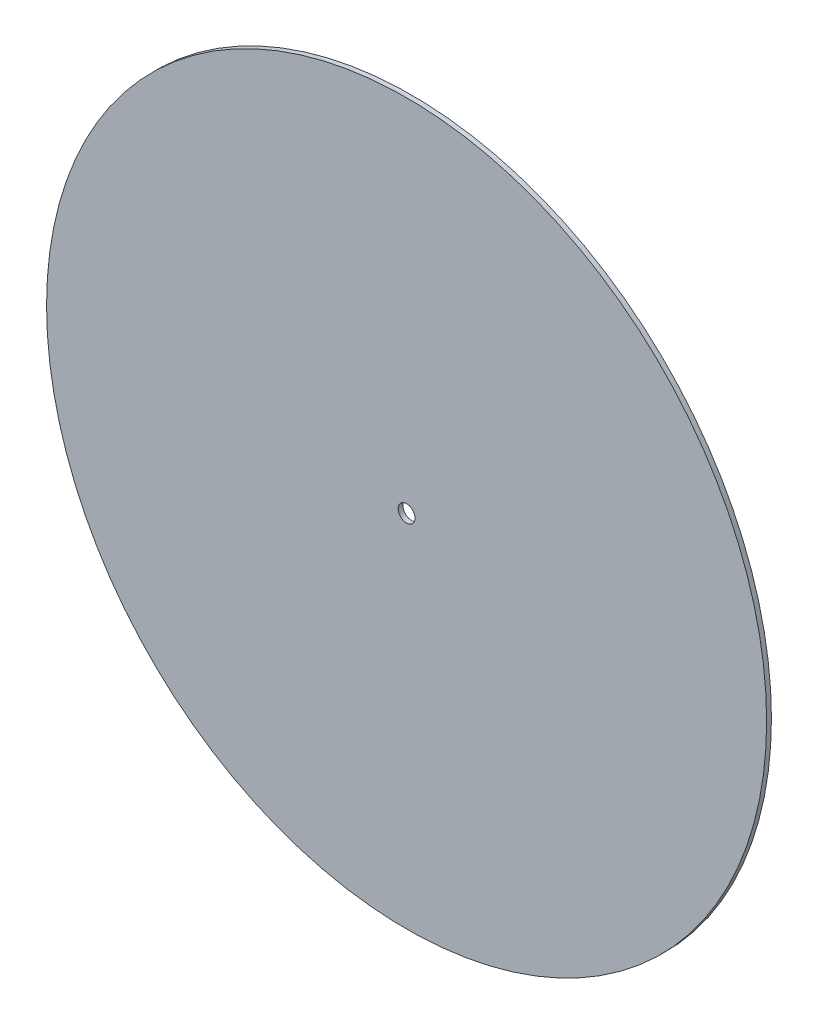
ISO-10303-21;
HEADER;
FILE_DESCRIPTION(('STEP AP214'),'2;1');
FILE_NAME('part.step','',(''),(''),'','','');
FILE_SCHEMA(('AUTOMOTIVE_DESIGN { 1 0 10303 214 1 1 1 1 }'));
ENDSEC;
DATA;
#1=APPLICATION_CONTEXT('core data for automotive mechanical design processes');
#2=APPLICATION_PROTOCOL_DEFINITION('international standard','automotive_design',2000,#1);
#3=PRODUCT_CONTEXT('',#1,'mechanical');
#4=PRODUCT('Part','Part','',(#3));
#5=PRODUCT_RELATED_PRODUCT_CATEGORY('part','',(#4));
#6=PRODUCT_DEFINITION_FORMATION('','',#4);
#7=PRODUCT_DEFINITION_CONTEXT('part definition',#1,'design');
#8=PRODUCT_DEFINITION('design','',#6,#7);
#9=PRODUCT_DEFINITION_SHAPE('','',#8);
#10=(LENGTH_UNIT() NAMED_UNIT(*) SI_UNIT(.MILLI.,.METRE.));
#11=(NAMED_UNIT(*) PLANE_ANGLE_UNIT() SI_UNIT($,.RADIAN.));
#12=(NAMED_UNIT(*) SI_UNIT($,.STERADIAN.) SOLID_ANGLE_UNIT());
#13=UNCERTAINTY_MEASURE_WITH_UNIT(LENGTH_MEASURE(1.E-05),#10,'distance_accuracy_value','');
#14=(GEOMETRIC_REPRESENTATION_CONTEXT(3) GLOBAL_UNCERTAINTY_ASSIGNED_CONTEXT((#13)) GLOBAL_UNIT_ASSIGNED_CONTEXT((#10,
#11,#12)) REPRESENTATION_CONTEXT('',''));
#15=CARTESIAN_POINT('',(0.,0.,0.));
#16=DIRECTION('',(0.,0.,1.));
#17=DIRECTION('',(1.,0.,0.));
#18=AXIS2_PLACEMENT_3D('',#15,#16,#17);
#19=CARTESIAN_POINT('',(0.,0.,0.));
#20=DIRECTION('',(0.,0.,1.));
#21=DIRECTION('',(1.,0.,0.));
#22=AXIS2_PLACEMENT_3D('',#19,#20,#21);
#23=PLANE('',#22);
#24=CARTESIAN_POINT('',(176.,173.,0.));
#25=DIRECTION('',(0.,0.,1.));
#26=DIRECTION('',(1.,0.,0.));
#27=AXIS2_PLACEMENT_3D('',#24,#25,#26);
#28=CIRCLE('',#27,3.5);
#29=CARTESIAN_POINT('',(179.5,173.,0.));
#30=VERTEX_POINT('',#29);
#31=EDGE_CURVE('E27',#30,#30,#28,.T.);
#32=ORIENTED_EDGE('',*,*,#31,.T.);
#33=EDGE_LOOP('',(#32));
#34=FACE_BOUND('',#33,.T.);
#35=CARTESIAN_POINT('',(176.,173.,0.));
#36=DIRECTION('',(0.,0.,1.));
#37=DIRECTION('',(1.,0.,0.));
#38=AXIS2_PLACEMENT_3D('',#35,#36,#37);
#39=CIRCLE('',#38,150.);
#40=CARTESIAN_POINT('',(326.,173.,0.));
#41=VERTEX_POINT('',#40);
#42=EDGE_CURVE('E18',#41,#41,#39,.T.);
#43=ORIENTED_EDGE('',*,*,#42,.F.);
#44=EDGE_LOOP('',(#43));
#45=FACE_BOUND('',#44,.T.);
#46=ADVANCED_FACE('F15',(#34,#45),#23,.F.);
#47=CARTESIAN_POINT('',(176.,173.,0.));
#48=DIRECTION('',(0.,0.,1.));
#49=DIRECTION('',(1.,0.,0.));
#50=AXIS2_PLACEMENT_3D('',#47,#48,#49);
#51=CYLINDRICAL_SURFACE('',#50,150.);
#52=ORIENTED_EDGE('',*,*,#42,.T.);
#53=EDGE_LOOP('',(#52));
#54=FACE_BOUND('',#53,.T.);
#55=CARTESIAN_POINT('',(176.,173.,2.));
#56=DIRECTION('',(0.,0.,1.));
#57=DIRECTION('',(1.,0.,0.));
#58=AXIS2_PLACEMENT_3D('',#55,#56,#57);
#59=CIRCLE('',#58,150.);
#60=CARTESIAN_POINT('',(326.,173.,2.));
#61=VERTEX_POINT('',#60);
#62=EDGE_CURVE('E22',#61,#61,#59,.T.);
#63=ORIENTED_EDGE('',*,*,#62,.F.);
#64=EDGE_LOOP('',(#63));
#65=FACE_BOUND('',#64,.T.);
#66=ADVANCED_FACE('F35',(#54,#65),#51,.T.);
#67=CARTESIAN_POINT('',(176.,173.,0.));
#68=DIRECTION('',(0.,0.,1.));
#69=DIRECTION('',(1.,0.,0.));
#70=AXIS2_PLACEMENT_3D('',#67,#68,#69);
#71=CYLINDRICAL_SURFACE('',#70,3.5);
#72=ORIENTED_EDGE('',*,*,#31,.F.);
#73=EDGE_LOOP('',(#72));
#74=FACE_BOUND('',#73,.T.);
#75=CARTESIAN_POINT('',(176.,173.,2.));
#76=DIRECTION('',(0.,0.,1.));
#77=DIRECTION('',(1.,0.,0.));
#78=AXIS2_PLACEMENT_3D('',#75,#76,#77);
#79=CIRCLE('',#78,3.5);
#80=CARTESIAN_POINT('',(179.5,173.,2.));
#81=VERTEX_POINT('',#80);
#82=EDGE_CURVE('E10',#81,#81,#79,.F.);
#83=ORIENTED_EDGE('',*,*,#82,.F.);
#84=EDGE_LOOP('',(#83));
#85=FACE_BOUND('',#84,.T.);
#86=ADVANCED_FACE('F43',(#74,#85),#71,.F.);
#87=CARTESIAN_POINT('',(0.,0.,2.));
#88=DIRECTION('',(0.,0.,1.));
#89=DIRECTION('',(1.,0.,0.));
#90=AXIS2_PLACEMENT_3D('',#87,#88,#89);
#91=PLANE('',#90);
#92=ORIENTED_EDGE('',*,*,#82,.T.);
#93=EDGE_LOOP('',(#92));
#94=FACE_BOUND('',#93,.T.);
#95=ORIENTED_EDGE('',*,*,#62,.T.);
#96=EDGE_LOOP('',(#95));
#97=FACE_BOUND('',#96,.T.);
#98=ADVANCED_FACE('F44',(#94,#97),#91,.T.);
#99=CLOSED_SHELL('',(#46,#66,#86,#98));
#100=MANIFOLD_SOLID_BREP('B1',#99);
#101=ADVANCED_BREP_SHAPE_REPRESENTATION('',(#18,#100),#14);
#102=SHAPE_DEFINITION_REPRESENTATION(#9,#101);
ENDSEC;
END-ISO-10303-21;
